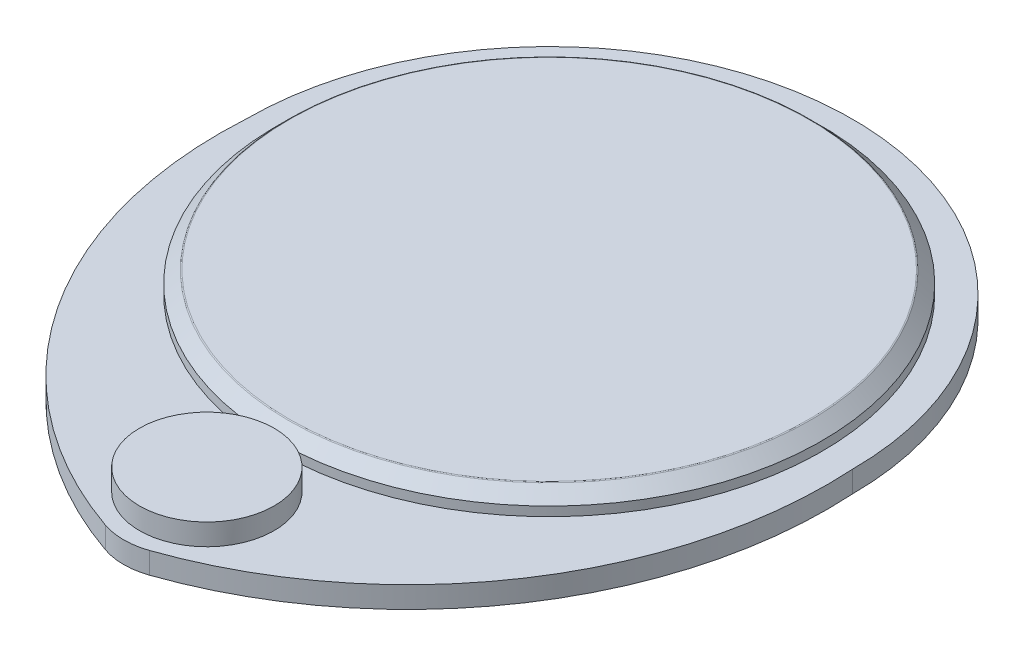
ISO-10303-21;
HEADER;
FILE_DESCRIPTION(('STEP AP214'),'2;1');
FILE_NAME('part.step','',(''),(''),'','','');
FILE_SCHEMA(('AUTOMOTIVE_DESIGN { 1 0 10303 214 1 1 1 1 }'));
ENDSEC;
DATA;
#1=APPLICATION_CONTEXT('core data for automotive mechanical design processes');
#2=APPLICATION_PROTOCOL_DEFINITION('international standard','automotive_design',2000,#1);
#3=PRODUCT_CONTEXT('',#1,'mechanical');
#4=PRODUCT('Part','Part','',(#3));
#5=PRODUCT_RELATED_PRODUCT_CATEGORY('part','',(#4));
#6=PRODUCT_DEFINITION_FORMATION('','',#4);
#7=PRODUCT_DEFINITION_CONTEXT('part definition',#1,'design');
#8=PRODUCT_DEFINITION('design','',#6,#7);
#9=PRODUCT_DEFINITION_SHAPE('','',#8);
#10=(LENGTH_UNIT() NAMED_UNIT(*) SI_UNIT(.MILLI.,.METRE.));
#11=(NAMED_UNIT(*) PLANE_ANGLE_UNIT() SI_UNIT($,.RADIAN.));
#12=(NAMED_UNIT(*) SI_UNIT($,.STERADIAN.) SOLID_ANGLE_UNIT());
#13=UNCERTAINTY_MEASURE_WITH_UNIT(LENGTH_MEASURE(1.E-05),#10,'distance_accuracy_value','');
#14=(GEOMETRIC_REPRESENTATION_CONTEXT(3) GLOBAL_UNCERTAINTY_ASSIGNED_CONTEXT((#13)) GLOBAL_UNIT_ASSIGNED_CONTEXT((#10,
#11,#12)) REPRESENTATION_CONTEXT('',''));
#15=CARTESIAN_POINT('',(0.,0.,0.));
#16=DIRECTION('',(0.,0.,1.));
#17=DIRECTION('',(1.,0.,0.));
#18=AXIS2_PLACEMENT_3D('',#15,#16,#17);
#19=CARTESIAN_POINT('',(0.,3.5,0.));
#20=DIRECTION('',(0.,-1.,0.));
#21=DIRECTION('',(0.,0.,-1.));
#22=AXIS2_PLACEMENT_3D('',#19,#20,#21);
#23=CYLINDRICAL_SURFACE('',#22,44.5);
#24=CARTESIAN_POINT('',(0.,1.50000000000001,0.));
#25=DIRECTION('',(0.,1.,0.));
#26=DIRECTION('',(0.,0.,1.));
#27=AXIS2_PLACEMENT_3D('',#24,#25,#26);
#28=CIRCLE('',#27,44.5);
#29=CARTESIAN_POINT('',(0.,1.50000000000001,44.5));
#30=VERTEX_POINT('',#29);
#31=EDGE_CURVE('E121',#30,#30,#28,.F.);
#32=ORIENTED_EDGE('',*,*,#31,.T.);
#33=EDGE_LOOP('',(#32));
#34=FACE_BOUND('',#33,.T.);
#35=CARTESIAN_POINT('',(0.,0.,0.));
#36=DIRECTION('',(0.,1.,0.));
#37=DIRECTION('',(0.,0.,1.));
#38=AXIS2_PLACEMENT_3D('',#35,#36,#37);
#39=CIRCLE('',#38,44.5);
#40=CARTESIAN_POINT('',(0.,0.,44.5));
#41=VERTEX_POINT('',#40);
#42=EDGE_CURVE('E117',#41,#41,#39,.T.);
#43=ORIENTED_EDGE('',*,*,#42,.T.);
#44=EDGE_LOOP('',(#43));
#45=FACE_BOUND('',#44,.T.);
#46=ADVANCED_FACE('F43',(#34,#45),#23,.T.);
#47=CARTESIAN_POINT('',(0.,3.5,0.));
#48=DIRECTION('',(0.,1.,0.));
#49=DIRECTION('',(0.,0.,1.));
#50=AXIS2_PLACEMENT_3D('',#47,#48,#49);
#51=PLANE('',#50);
#52=CARTESIAN_POINT('',(0.,3.5,0.));
#53=DIRECTION('',(0.,1.,0.));
#54=DIRECTION('',(0.,0.,1.));
#55=AXIS2_PLACEMENT_3D('',#52,#53,#54);
#56=CIRCLE('',#55,42.3964466094067);
#57=CARTESIAN_POINT('',(0.,3.5,42.3964466094067));
#58=VERTEX_POINT('',#57);
#59=EDGE_CURVE('E51',#58,#58,#56,.T.);
#60=ORIENTED_EDGE('',*,*,#59,.T.);
#61=EDGE_LOOP('',(#60));
#62=FACE_BOUND('',#61,.T.);
#63=ADVANCED_FACE('F134',(#62),#51,.T.);
#64=CARTESIAN_POINT('',(0.,3.5,0.));
#65=DIRECTION('',(0.,-1.,0.));
#66=DIRECTION('',(0.,0.,-1.));
#67=AXIS2_PLACEMENT_3D('',#64,#65,#66);
#68=CONICAL_SURFACE('',#67,42.5,0.785398163397448);
#69=CARTESIAN_POINT('',(0.,3.42677669529664,0.));
#70=DIRECTION('',(0.,1.,0.));
#71=DIRECTION('',(0.,0.,1.));
#72=AXIS2_PLACEMENT_3D('',#69,#70,#71);
#73=CIRCLE('',#72,42.5732233047034);
#74=CARTESIAN_POINT('',(0.,3.42677669529664,42.5732233047034));
#75=VERTEX_POINT('',#74);
#76=EDGE_CURVE('E12',#75,#75,#73,.F.);
#77=ORIENTED_EDGE('',*,*,#76,.T.);
#78=EDGE_LOOP('',(#77));
#79=FACE_BOUND('',#78,.T.);
#80=ORIENTED_EDGE('',*,*,#31,.F.);
#81=EDGE_LOOP('',(#80));
#82=FACE_BOUND('',#81,.T.);
#83=ADVANCED_FACE('F151',(#79,#82),#68,.T.);
#84=CARTESIAN_POINT('',(0.,-3.5,0.));
#85=DIRECTION('',(0.,1.,0.));
#86=DIRECTION('',(0.,0.,1.));
#87=AXIS2_PLACEMENT_3D('',#84,#85,#86);
#88=CYLINDRICAL_SURFACE('',#87,49.5);
#89=CARTESIAN_POINT('',(0.,0.,0.));
#90=DIRECTION('',(0.,-1.,0.));
#91=DIRECTION('',(0.,0.,-1.));
#92=AXIS2_PLACEMENT_3D('',#89,#90,#91);
#93=CIRCLE('',#92,49.5);
#94=CARTESIAN_POINT('',(-49.5,0.,0.));
#95=VERTEX_POINT('',#94);
#96=CARTESIAN_POINT('',(49.5,0.,-3.59087759527199E-13));
#97=VERTEX_POINT('',#96);
#98=EDGE_CURVE('E82',#95,#97,#93,.T.);
#99=ORIENTED_EDGE('',*,*,#98,.T.);
#100=DIRECTION('',(0.,1.,0.));
#101=VECTOR('',#100,1.);
#102=CARTESIAN_POINT('',(49.5,-3.5,0.));
#103=LINE('',#102,#101);
#104=CARTESIAN_POINT('',(49.5,-3.5,-3.59087759527199E-13));
#105=VERTEX_POINT('',#104);
#106=EDGE_CURVE('E92',#105,#97,#103,.T.);
#107=ORIENTED_EDGE('',*,*,#106,.F.);
#108=CARTESIAN_POINT('',(0.,-3.5,0.));
#109=DIRECTION('',(0.,-1.,0.));
#110=DIRECTION('',(0.,0.,-1.));
#111=AXIS2_PLACEMENT_3D('',#108,#109,#110);
#112=CIRCLE('',#111,49.5);
#113=CARTESIAN_POINT('',(-49.5,-3.5,-3.59087759527199E-13));
#114=VERTEX_POINT('',#113);
#115=EDGE_CURVE('E91',#114,#105,#112,.T.);
#116=ORIENTED_EDGE('',*,*,#115,.F.);
#117=DIRECTION('',(0.,1.,0.));
#118=VECTOR('',#117,1.);
#119=CARTESIAN_POINT('',(-49.5,-3.5,0.));
#120=LINE('',#119,#118);
#121=EDGE_CURVE('E95',#114,#95,#120,.T.);
#122=ORIENTED_EDGE('',*,*,#121,.T.);
#123=EDGE_LOOP('',(#99,#107,#116,#122));
#124=FACE_BOUND('',#123,.T.);
#125=ADVANCED_FACE('F96',(#124),#88,.T.);
#126=CARTESIAN_POINT('',(0.,-3.5,0.));
#127=DIRECTION('',(0.,-1.,0.));
#128=DIRECTION('',(0.,0.,-1.));
#129=AXIS2_PLACEMENT_3D('',#126,#127,#128);
#130=PLANE('',#129);
#131=CARTESIAN_POINT('',(-18.843186935348,-3.5,4.17338923857533));
#132=DIRECTION('',(0.,1.,0.));
#133=DIRECTION('',(0.,0.,-1.));
#134=AXIS2_PLACEMENT_3D('',#131,#132,#133);
#135=CIRCLE('',#134,68.47049275576);
#136=CARTESIAN_POINT('',(3.60663440227862,-3.5,68.8588891603138));
#137=VERTEX_POINT('',#136);
#138=EDGE_CURVE('E101',#137,#105,#135,.T.);
#139=ORIENTED_EDGE('',*,*,#138,.F.);
#140=CARTESIAN_POINT('',(0.,-3.5,58.4669601628514));
#141=DIRECTION('',(0.,-1.,0.));
#142=DIRECTION('',(0.,0.,-1.));
#143=AXIS2_PLACEMENT_3D('',#140,#141,#142);
#144=CIRCLE('',#143,11.);
#145=CARTESIAN_POINT('',(-3.60663440227862,-3.5,68.8588891603138));
#146=VERTEX_POINT('',#145);
#147=EDGE_CURVE('E130',#137,#146,#144,.T.);
#148=ORIENTED_EDGE('',*,*,#147,.T.);
#149=CARTESIAN_POINT('',(18.843186935348,-3.5,4.17338923857533));
#150=DIRECTION('',(0.,1.,0.));
#151=DIRECTION('',(0.,0.,1.));
#152=AXIS2_PLACEMENT_3D('',#149,#150,#151);
#153=CIRCLE('',#152,68.47049275576);
#154=EDGE_CURVE('E109',#114,#146,#153,.T.);
#155=ORIENTED_EDGE('',*,*,#154,.F.);
#156=ORIENTED_EDGE('',*,*,#115,.T.);
#157=EDGE_LOOP('',(#139,#148,#155,#156));
#158=FACE_BOUND('',#157,.T.);
#159=ADVANCED_FACE('F164',(#158),#130,.T.);
#160=CARTESIAN_POINT('',(0.,0.,0.));
#161=DIRECTION('',(0.,-1.,0.));
#162=DIRECTION('',(0.,0.,-1.));
#163=AXIS2_PLACEMENT_3D('',#160,#161,#162);
#164=PLANE('',#163);
#165=CARTESIAN_POINT('',(0.,0.,55.89202753157));
#166=DIRECTION('',(0.,-1.,0.));
#167=DIRECTION('',(0.,0.,-1.));
#168=AXIS2_PLACEMENT_3D('',#165,#166,#167);
#169=CIRCLE('',#168,10.9916869323902);
#170=CARTESIAN_POINT('',(0.,0.,44.9003405991798));
#171=VERTEX_POINT('',#170);
#172=EDGE_CURVE('E124',#171,#171,#169,.F.);
#173=ORIENTED_EDGE('',*,*,#172,.F.);
#174=EDGE_LOOP('',(#173));
#175=FACE_BOUND('',#174,.T.);
#176=ORIENTED_EDGE('',*,*,#42,.F.);
#177=EDGE_LOOP('',(#176));
#178=FACE_BOUND('',#177,.T.);
#179=CARTESIAN_POINT('',(18.843186935348,0.,4.17338923857533));
#180=DIRECTION('',(0.,1.,0.));
#181=DIRECTION('',(0.,0.,1.));
#182=AXIS2_PLACEMENT_3D('',#179,#180,#181);
#183=CIRCLE('',#182,68.47049275576);
#184=CARTESIAN_POINT('',(-3.60663440227862,0.,68.8588891603138));
#185=VERTEX_POINT('',#184);
#186=EDGE_CURVE('E86',#95,#185,#183,.T.);
#187=ORIENTED_EDGE('',*,*,#186,.T.);
#188=CARTESIAN_POINT('',(0.,0.,58.4669601628514));
#189=DIRECTION('',(0.,-1.,0.));
#190=DIRECTION('',(0.,0.,-1.));
#191=AXIS2_PLACEMENT_3D('',#188,#189,#190);
#192=CIRCLE('',#191,11.);
#193=CARTESIAN_POINT('',(3.60663440227862,0.,68.8588891603138));
#194=VERTEX_POINT('',#193);
#195=EDGE_CURVE('E66',#185,#194,#192,.F.);
#196=ORIENTED_EDGE('',*,*,#195,.T.);
#197=CARTESIAN_POINT('',(-18.843186935348,0.,4.17338923857533));
#198=DIRECTION('',(0.,1.,0.));
#199=DIRECTION('',(0.,0.,-1.));
#200=AXIS2_PLACEMENT_3D('',#197,#198,#199);
#201=CIRCLE('',#200,68.47049275576);
#202=EDGE_CURVE('E87',#194,#97,#201,.T.);
#203=ORIENTED_EDGE('',*,*,#202,.T.);
#204=ORIENTED_EDGE('',*,*,#98,.F.);
#205=EDGE_LOOP('',(#187,#196,#203,#204));
#206=FACE_BOUND('',#205,.T.);
#207=ADVANCED_FACE('F84',(#175,#178,#206),#164,.F.);
#208=CARTESIAN_POINT('',(-18.843186935348,-3.5,4.17338923857533));
#209=DIRECTION('',(0.,1.,0.));
#210=DIRECTION('',(0.,0.,1.));
#211=AXIS2_PLACEMENT_3D('',#208,#209,#210);
#212=CYLINDRICAL_SURFACE('',#211,68.47049275576);
#213=ORIENTED_EDGE('',*,*,#202,.F.);
#214=DIRECTION('',(0.,1.,0.));
#215=VECTOR('',#214,1.);
#216=CARTESIAN_POINT('',(3.60663440227862,-3.5,68.8588891603138));
#217=LINE('',#216,#215);
#218=EDGE_CURVE('E58',#194,#137,#217,.F.);
#219=ORIENTED_EDGE('',*,*,#218,.T.);
#220=ORIENTED_EDGE('',*,*,#138,.T.);
#221=ORIENTED_EDGE('',*,*,#106,.T.);
#222=EDGE_LOOP('',(#213,#219,#220,#221));
#223=FACE_BOUND('',#222,.T.);
#224=ADVANCED_FACE('F174',(#223),#212,.T.);
#225=CARTESIAN_POINT('',(18.843186935348,-3.5,4.17338923857533));
#226=DIRECTION('',(0.,1.,0.));
#227=DIRECTION('',(0.,0.,1.));
#228=AXIS2_PLACEMENT_3D('',#225,#226,#227);
#229=CYLINDRICAL_SURFACE('',#228,68.47049275576);
#230=ORIENTED_EDGE('',*,*,#154,.T.);
#231=DIRECTION('',(0.,1.,0.));
#232=VECTOR('',#231,1.);
#233=CARTESIAN_POINT('',(-3.60663440227862,-3.5,68.8588891603138));
#234=LINE('',#233,#232);
#235=EDGE_CURVE('E106',#146,#185,#234,.T.);
#236=ORIENTED_EDGE('',*,*,#235,.T.);
#237=ORIENTED_EDGE('',*,*,#186,.F.);
#238=ORIENTED_EDGE('',*,*,#121,.F.);
#239=EDGE_LOOP('',(#230,#236,#237,#238));
#240=FACE_BOUND('',#239,.T.);
#241=ADVANCED_FACE('F104',(#240),#229,.T.);
#242=CARTESIAN_POINT('',(0.,3.5,55.89202753157));
#243=DIRECTION('',(0.,-1.,0.));
#244=DIRECTION('',(0.,0.,-1.));
#245=AXIS2_PLACEMENT_3D('',#242,#243,#244);
#246=CYLINDRICAL_SURFACE('',#245,10.9916869323902);
#247=CARTESIAN_POINT('',(0.,3.5,55.89202753157));
#248=DIRECTION('',(0.,1.,0.));
#249=DIRECTION('',(0.,0.,1.));
#250=AXIS2_PLACEMENT_3D('',#247,#248,#249);
#251=CIRCLE('',#250,10.9916869323902);
#252=CARTESIAN_POINT('',(0.,3.5,66.8837144639602));
#253=VERTEX_POINT('',#252);
#254=EDGE_CURVE('E107',#253,#253,#251,.T.);
#255=ORIENTED_EDGE('',*,*,#254,.F.);
#256=EDGE_LOOP('',(#255));
#257=FACE_BOUND('',#256,.T.);
#258=ORIENTED_EDGE('',*,*,#172,.T.);
#259=EDGE_LOOP('',(#258));
#260=FACE_BOUND('',#259,.T.);
#261=ADVANCED_FACE('F179',(#257,#260),#246,.T.);
#262=CARTESIAN_POINT('',(0.,3.5,55.89202753157));
#263=DIRECTION('',(0.,1.,0.));
#264=DIRECTION('',(0.,0.,1.));
#265=AXIS2_PLACEMENT_3D('',#262,#263,#264);
#266=PLANE('',#265);
#267=ORIENTED_EDGE('',*,*,#254,.T.);
#268=EDGE_LOOP('',(#267));
#269=FACE_BOUND('',#268,.T.);
#270=ADVANCED_FACE('F142',(#269),#266,.T.);
#271=CARTESIAN_POINT('',(0.,-3.5,58.4669601628514));
#272=DIRECTION('',(0.,1.,0.));
#273=DIRECTION('',(0.,0.,1.));
#274=AXIS2_PLACEMENT_3D('',#271,#272,#273);
#275=CYLINDRICAL_SURFACE('',#274,11.);
#276=ORIENTED_EDGE('',*,*,#147,.F.);
#277=ORIENTED_EDGE('',*,*,#218,.F.);
#278=ORIENTED_EDGE('',*,*,#195,.F.);
#279=ORIENTED_EDGE('',*,*,#235,.F.);
#280=EDGE_LOOP('',(#276,#277,#278,#279));
#281=FACE_BOUND('',#280,.T.);
#282=ADVANCED_FACE('F137',(#281),#275,.T.);
#283=CARTESIAN_POINT('',(0.,3.25,0.));
#284=DIRECTION('',(0.,1.,0.));
#285=DIRECTION('',(0.,0.,1.));
#286=AXIS2_PLACEMENT_3D('',#283,#284,#285);
#287=TOROIDAL_SURFACE('',#286,42.3964466094067,0.25);
#288=ORIENTED_EDGE('',*,*,#76,.F.);
#289=EDGE_LOOP('',(#288));
#290=FACE_BOUND('',#289,.T.);
#291=ORIENTED_EDGE('',*,*,#59,.F.);
#292=EDGE_LOOP('',(#291));
#293=FACE_BOUND('',#292,.T.);
#294=ADVANCED_FACE('F45',(#290,#293),#287,.T.);
#295=CLOSED_SHELL('',(#46,#63,#83,#125,#159,#207,#224,#241,#261,#270,#282,#294));
#296=MANIFOLD_SOLID_BREP('B2',#295);
#297=ADVANCED_BREP_SHAPE_REPRESENTATION('',(#18,#296),#14);
#298=SHAPE_DEFINITION_REPRESENTATION(#9,#297);
ENDSEC;
END-ISO-10303-21;
